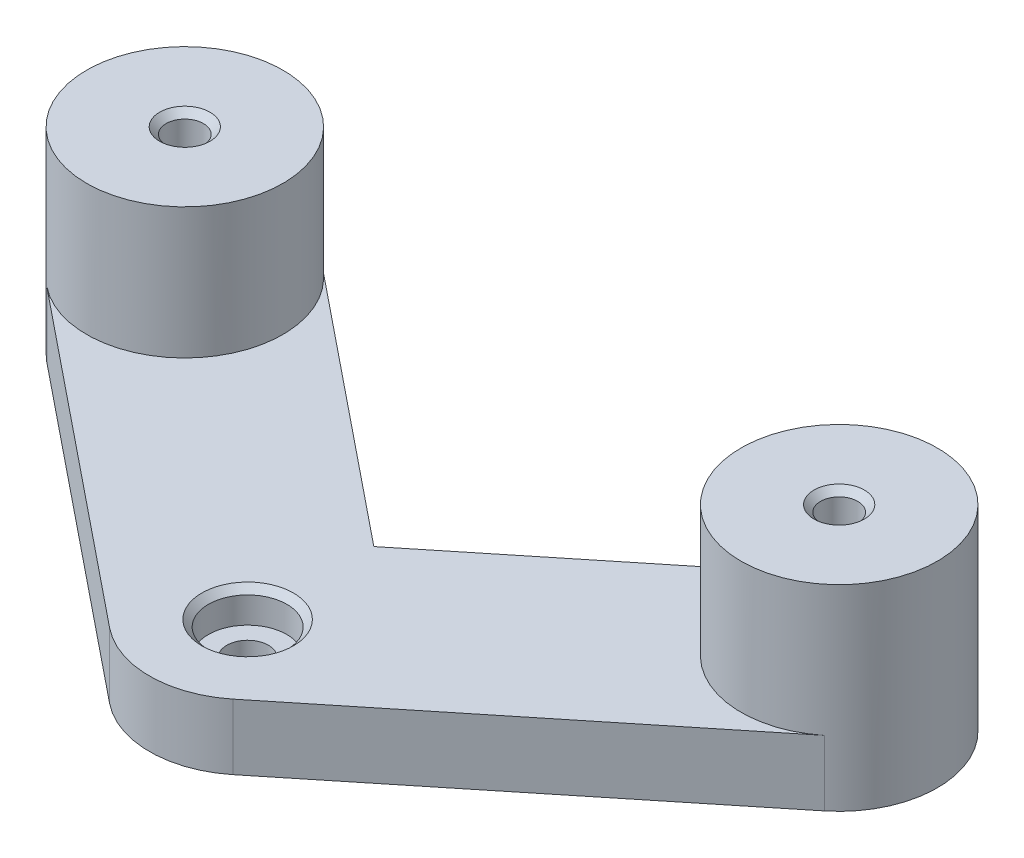
ISO-10303-21;
HEADER;
FILE_DESCRIPTION(('STEP AP214'),'2;1');
FILE_NAME('part.step','',(''),(''),'','','');
FILE_SCHEMA(('AUTOMOTIVE_DESIGN { 1 0 10303 214 1 1 1 1 }'));
ENDSEC;
DATA;
#1=APPLICATION_CONTEXT('core data for automotive mechanical design processes');
#2=APPLICATION_PROTOCOL_DEFINITION('international standard','automotive_design',2000,#1);
#3=PRODUCT_CONTEXT('',#1,'mechanical');
#4=PRODUCT('Part','Part','',(#3));
#5=PRODUCT_RELATED_PRODUCT_CATEGORY('part','',(#4));
#6=PRODUCT_DEFINITION_FORMATION('','',#4);
#7=PRODUCT_DEFINITION_CONTEXT('part definition',#1,'design');
#8=PRODUCT_DEFINITION('design','',#6,#7);
#9=PRODUCT_DEFINITION_SHAPE('','',#8);
#10=(LENGTH_UNIT() NAMED_UNIT(*) SI_UNIT(.MILLI.,.METRE.));
#11=(NAMED_UNIT(*) PLANE_ANGLE_UNIT() SI_UNIT($,.RADIAN.));
#12=(NAMED_UNIT(*) SI_UNIT($,.STERADIAN.) SOLID_ANGLE_UNIT());
#13=UNCERTAINTY_MEASURE_WITH_UNIT(LENGTH_MEASURE(1.E-05),#10,'distance_accuracy_value','');
#14=(GEOMETRIC_REPRESENTATION_CONTEXT(3) GLOBAL_UNCERTAINTY_ASSIGNED_CONTEXT((#13)) GLOBAL_UNIT_ASSIGNED_CONTEXT((#10,
#11,#12)) REPRESENTATION_CONTEXT('',''));
#15=CARTESIAN_POINT('',(0.,0.,0.));
#16=DIRECTION('',(0.,0.,1.));
#17=DIRECTION('',(1.,0.,0.));
#18=AXIS2_PLACEMENT_3D('',#15,#16,#17);
#19=CARTESIAN_POINT('',(0.,10.,127.));
#20=DIRECTION('',(0.,-1.,0.));
#21=DIRECTION('',(0.,0.,-1.));
#22=AXIS2_PLACEMENT_3D('',#19,#20,#21);
#23=CYLINDRICAL_SURFACE('',#22,3.17499999999998);
#24=CARTESIAN_POINT('',(0.,0.,127.));
#25=DIRECTION('',(0.,1.,0.));
#26=DIRECTION('',(0.,0.,1.));
#27=AXIS2_PLACEMENT_3D('',#24,#25,#26);
#28=CIRCLE('',#27,3.17499999999998);
#29=CARTESIAN_POINT('',(0.,0.,130.175));
#30=VERTEX_POINT('',#29);
#31=EDGE_CURVE('E140',#30,#30,#28,.T.);
#32=ORIENTED_EDGE('',*,*,#31,.F.);
#33=EDGE_LOOP('',(#32));
#34=FACE_BOUND('',#33,.T.);
#35=CARTESIAN_POINT('',(0.,5.,127.));
#36=DIRECTION('',(0.,1.,0.));
#37=DIRECTION('',(0.,0.,1.));
#38=AXIS2_PLACEMENT_3D('',#35,#36,#37);
#39=CIRCLE('',#38,3.17499999999998);
#40=CARTESIAN_POINT('',(0.,5.,130.175));
#41=VERTEX_POINT('',#40);
#42=EDGE_CURVE('E159',#41,#41,#39,.T.);
#43=ORIENTED_EDGE('',*,*,#42,.T.);
#44=EDGE_LOOP('',(#43));
#45=FACE_BOUND('',#44,.T.);
#46=ADVANCED_FACE('F39',(#34,#45),#23,.F.);
#47=CARTESIAN_POINT('',(-50.000000000001,10.,86.6025403784433));
#48=DIRECTION('',(0.,1.,0.));
#49=DIRECTION('',(0.,0.,1.));
#50=AXIS2_PLACEMENT_3D('',#47,#48,#49);
#51=PLANE('',#50);
#52=CARTESIAN_POINT('',(0.,10.,127.));
#53=DIRECTION('',(0.,1.,0.));
#54=DIRECTION('',(0.,0.,1.));
#55=AXIS2_PLACEMENT_3D('',#52,#53,#54);
#56=CIRCLE('',#55,7.00000000000001);
#57=CARTESIAN_POINT('',(0.,10.,134.));
#58=VERTEX_POINT('',#57);
#59=EDGE_CURVE('E173',#58,#58,#56,.F.);
#60=ORIENTED_EDGE('',*,*,#59,.T.);
#61=EDGE_LOOP('',(#60));
#62=FACE_BOUND('',#61,.T.);
#63=DIRECTION('',(0.777843498823097,0.,-0.628458026711922));
#64=VECTOR('',#63,1.);
#65=CARTESIAN_POINT('',(9.42687040067889,10.,138.667652482346));
#66=LINE('',#65,#64);
#67=CARTESIAN_POINT('',(9.42687040067889,10.,138.667652482346));
#68=VERTEX_POINT('',#67);
#69=CARTESIAN_POINT('',(59.426870400678,10.,98.2701928607908));
#70=VERTEX_POINT('',#69);
#71=EDGE_CURVE('E109',#68,#70,#66,.T.);
#72=ORIENTED_EDGE('',*,*,#71,.T.);
#73=CARTESIAN_POINT('',(49.9999999999992,10.,86.6025403784444));
#74=DIRECTION('',(0.,1.,0.));
#75=DIRECTION('',(0.,0.,1.));
#76=AXIS2_PLACEMENT_3D('',#73,#74,#75);
#77=CIRCLE('',#76,15.);
#78=CARTESIAN_POINT('',(40.5731295993204,10.,74.9348878960979));
#79=VERTEX_POINT('',#78);
#80=EDGE_CURVE('E266',#79,#70,#77,.T.);
#81=ORIENTED_EDGE('',*,*,#80,.F.);
#82=DIRECTION('',(-0.777843498823097,0.,0.628458026711922));
#83=VECTOR('',#82,1.);
#84=CARTESIAN_POINT('',(0.,10.,107.715915190272));
#85=LINE('',#84,#83);
#86=CARTESIAN_POINT('',(0.,10.,107.715915190272));
#87=VERTEX_POINT('',#86);
#88=EDGE_CURVE('E57',#79,#87,#85,.T.);
#89=ORIENTED_EDGE('',*,*,#88,.T.);
#90=DIRECTION('',(-0.7778434988231,0.,-0.628458026711918));
#91=VECTOR('',#90,1.);
#92=CARTESIAN_POINT('',(-40.5731295993223,10.,74.9348878960968));
#93=LINE('',#92,#91);
#94=CARTESIAN_POINT('',(-40.5731295993223,10.,74.9348878960968));
#95=VERTEX_POINT('',#94);
#96=EDGE_CURVE('E130',#87,#95,#93,.T.);
#97=ORIENTED_EDGE('',*,*,#96,.T.);
#98=CARTESIAN_POINT('',(-50.000000000001,10.,86.6025403784433));
#99=DIRECTION('',(0.,1.,0.));
#100=DIRECTION('',(0.,0.,1.));
#101=AXIS2_PLACEMENT_3D('',#98,#99,#100);
#102=CIRCLE('',#101,15.);
#103=CARTESIAN_POINT('',(-59.4268704006798,10.,98.2701928607898));
#104=VERTEX_POINT('',#103);
#105=EDGE_CURVE('E98',#104,#95,#102,.T.);
#106=ORIENTED_EDGE('',*,*,#105,.F.);
#107=DIRECTION('',(0.7778434988231,0.,0.628458026711918));
#108=VECTOR('',#107,1.);
#109=CARTESIAN_POINT('',(-59.4268704006798,10.,98.2701928607898));
#110=LINE('',#109,#108);
#111=CARTESIAN_POINT('',(-9.42687040067872,10.,138.667652482346));
#112=VERTEX_POINT('',#111);
#113=EDGE_CURVE('E111',#104,#112,#110,.T.);
#114=ORIENTED_EDGE('',*,*,#113,.T.);
#115=CARTESIAN_POINT('',(0.,10.,127.));
#116=DIRECTION('',(0.,1.,0.));
#117=DIRECTION('',(0.,0.,1.));
#118=AXIS2_PLACEMENT_3D('',#115,#116,#117);
#119=CIRCLE('',#118,15.);
#120=EDGE_CURVE('E105',#112,#68,#119,.T.);
#121=ORIENTED_EDGE('',*,*,#120,.T.);
#122=EDGE_LOOP('',(#72,#81,#89,#97,#106,#114,#121));
#123=FACE_BOUND('',#122,.T.);
#124=ADVANCED_FACE('F107',(#62,#123),#51,.T.);
#125=CARTESIAN_POINT('',(-50.000000000001,0.,86.6025403784433));
#126=DIRECTION('',(0.,1.,0.));
#127=DIRECTION('',(0.,0.,1.));
#128=AXIS2_PLACEMENT_3D('',#125,#126,#127);
#129=PLANE('',#128);
#130=CARTESIAN_POINT('',(-50.000000000001,0.,86.6025403784433));
#131=DIRECTION('',(0.,1.,0.));
#132=DIRECTION('',(0.,0.,1.));
#133=AXIS2_PLACEMENT_3D('',#130,#131,#132);
#134=CIRCLE('',#133,2.85);
#135=CARTESIAN_POINT('',(-50.000000000001,0.,89.4525403784433));
#136=VERTEX_POINT('',#135);
#137=EDGE_CURVE('E259',#136,#136,#134,.T.);
#138=ORIENTED_EDGE('',*,*,#137,.T.);
#139=EDGE_LOOP('',(#138));
#140=FACE_BOUND('',#139,.T.);
#141=CARTESIAN_POINT('',(49.9999999999992,0.,86.6025403784444));
#142=DIRECTION('',(0.,1.,0.));
#143=DIRECTION('',(0.,0.,1.));
#144=AXIS2_PLACEMENT_3D('',#141,#142,#143);
#145=CIRCLE('',#144,2.85);
#146=CARTESIAN_POINT('',(49.9999999999992,0.,89.4525403784444));
#147=VERTEX_POINT('',#146);
#148=EDGE_CURVE('E162',#147,#147,#145,.T.);
#149=ORIENTED_EDGE('',*,*,#148,.T.);
#150=EDGE_LOOP('',(#149));
#151=FACE_BOUND('',#150,.T.);
#152=CARTESIAN_POINT('',(-50.000000000001,0.,86.6025403784433));
#153=DIRECTION('',(0.,1.,0.));
#154=DIRECTION('',(0.,0.,1.));
#155=AXIS2_PLACEMENT_3D('',#152,#153,#154);
#156=CIRCLE('',#155,15.);
#157=CARTESIAN_POINT('',(-40.5731295993223,0.,74.9348878960968));
#158=VERTEX_POINT('',#157);
#159=CARTESIAN_POINT('',(-59.4268704006798,0.,98.2701928607898));
#160=VERTEX_POINT('',#159);
#161=EDGE_CURVE('E136',#158,#160,#156,.T.);
#162=ORIENTED_EDGE('',*,*,#161,.F.);
#163=DIRECTION('',(-0.7778434988231,0.,-0.628458026711918));
#164=VECTOR('',#163,1.);
#165=CARTESIAN_POINT('',(-40.5731295993223,0.,74.9348878960968));
#166=LINE('',#165,#164);
#167=CARTESIAN_POINT('',(0.,0.,107.715915190272));
#168=VERTEX_POINT('',#167);
#169=EDGE_CURVE('E91',#168,#158,#166,.T.);
#170=ORIENTED_EDGE('',*,*,#169,.F.);
#171=DIRECTION('',(-0.777843498823097,0.,0.628458026711922));
#172=VECTOR('',#171,1.);
#173=CARTESIAN_POINT('',(0.,0.,107.715915190272));
#174=LINE('',#173,#172);
#175=CARTESIAN_POINT('',(40.5731295993204,0.,74.9348878960979));
#176=VERTEX_POINT('',#175);
#177=EDGE_CURVE('E84',#176,#168,#174,.T.);
#178=ORIENTED_EDGE('',*,*,#177,.F.);
#179=CARTESIAN_POINT('',(49.9999999999992,0.,86.6025403784444));
#180=DIRECTION('',(0.,1.,0.));
#181=DIRECTION('',(0.,0.,1.));
#182=AXIS2_PLACEMENT_3D('',#179,#180,#181);
#183=CIRCLE('',#182,15.);
#184=CARTESIAN_POINT('',(59.426870400678,0.,98.2701928607908));
#185=VERTEX_POINT('',#184);
#186=EDGE_CURVE('E145',#185,#176,#183,.T.);
#187=ORIENTED_EDGE('',*,*,#186,.F.);
#188=DIRECTION('',(0.777843498823097,0.,-0.628458026711922));
#189=VECTOR('',#188,1.);
#190=CARTESIAN_POINT('',(9.42687040067889,0.,138.667652482346));
#191=LINE('',#190,#189);
#192=CARTESIAN_POINT('',(9.42687040067889,0.,138.667652482346));
#193=VERTEX_POINT('',#192);
#194=EDGE_CURVE('E143',#193,#185,#191,.T.);
#195=ORIENTED_EDGE('',*,*,#194,.F.);
#196=CARTESIAN_POINT('',(0.,0.,127.));
#197=DIRECTION('',(0.,1.,0.));
#198=DIRECTION('',(0.,0.,1.));
#199=AXIS2_PLACEMENT_3D('',#196,#197,#198);
#200=CIRCLE('',#199,15.);
#201=CARTESIAN_POINT('',(-9.42687040067872,0.,138.667652482346));
#202=VERTEX_POINT('',#201);
#203=EDGE_CURVE('E120',#202,#193,#200,.T.);
#204=ORIENTED_EDGE('',*,*,#203,.F.);
#205=DIRECTION('',(0.7778434988231,0.,0.628458026711918));
#206=VECTOR('',#205,1.);
#207=CARTESIAN_POINT('',(-59.4268704006798,0.,98.2701928607898));
#208=LINE('',#207,#206);
#209=EDGE_CURVE('E139',#160,#202,#208,.T.);
#210=ORIENTED_EDGE('',*,*,#209,.F.);
#211=EDGE_LOOP('',(#162,#170,#178,#187,#195,#204,#210));
#212=FACE_BOUND('',#211,.T.);
#213=ORIENTED_EDGE('',*,*,#31,.T.);
#214=EDGE_LOOP('',(#213));
#215=FACE_BOUND('',#214,.T.);
#216=ADVANCED_FACE('F196',(#140,#151,#212,#215),#129,.F.);
#217=CARTESIAN_POINT('',(-50.000000000001,10.,86.6025403784433));
#218=DIRECTION('',(0.,-1.,0.));
#219=DIRECTION('',(0.,0.,-1.));
#220=AXIS2_PLACEMENT_3D('',#217,#218,#219);
#221=CYLINDRICAL_SURFACE('',#220,15.);
#222=ORIENTED_EDGE('',*,*,#161,.T.);
#223=DIRECTION('',(0.,-1.,0.));
#224=VECTOR('',#223,1.);
#225=CARTESIAN_POINT('',(-59.4268704006798,10.,98.2701928607898));
#226=LINE('',#225,#224);
#227=EDGE_CURVE('E156',#104,#160,#226,.T.);
#228=ORIENTED_EDGE('',*,*,#227,.F.);
#229=ORIENTED_EDGE('',*,*,#105,.T.);
#230=DIRECTION('',(0.,-1.,0.));
#231=VECTOR('',#230,1.);
#232=CARTESIAN_POINT('',(-40.5731295993223,10.,74.9348878960968));
#233=LINE('',#232,#231);
#234=EDGE_CURVE('E135',#95,#158,#233,.T.);
#235=ORIENTED_EDGE('',*,*,#234,.T.);
#236=EDGE_LOOP('',(#222,#228,#229,#235));
#237=FACE_BOUND('',#236,.T.);
#238=CARTESIAN_POINT('',(-50.000000000001,30.,86.6025403784433));
#239=DIRECTION('',(0.,1.,0.));
#240=DIRECTION('',(0.,0.,1.));
#241=AXIS2_PLACEMENT_3D('',#238,#239,#240);
#242=CIRCLE('',#241,15.);
#243=CARTESIAN_POINT('',(-50.000000000001,30.,101.602540378443));
#244=VERTEX_POINT('',#243);
#245=EDGE_CURVE('E268',#244,#244,#242,.T.);
#246=ORIENTED_EDGE('',*,*,#245,.F.);
#247=EDGE_LOOP('',(#246));
#248=FACE_BOUND('',#247,.T.);
#249=ADVANCED_FACE('F207',(#237,#248),#221,.T.);
#250=CARTESIAN_POINT('',(-59.4268704006798,10.,98.2701928607898));
#251=DIRECTION('',(0.628458026711918,0.,-0.7778434988231));
#252=DIRECTION('',(-0.7778434988231,0.,-0.628458026711918));
#253=AXIS2_PLACEMENT_3D('',#250,#251,#252);
#254=PLANE('',#253);
#255=ORIENTED_EDGE('',*,*,#209,.T.);
#256=DIRECTION('',(0.,-1.,0.));
#257=VECTOR('',#256,1.);
#258=CARTESIAN_POINT('',(-9.42687040067872,10.,138.667652482346));
#259=LINE('',#258,#257);
#260=EDGE_CURVE('E123',#112,#202,#259,.T.);
#261=ORIENTED_EDGE('',*,*,#260,.F.);
#262=ORIENTED_EDGE('',*,*,#113,.F.);
#263=ORIENTED_EDGE('',*,*,#227,.T.);
#264=EDGE_LOOP('',(#255,#261,#262,#263));
#265=FACE_BOUND('',#264,.T.);
#266=ADVANCED_FACE('F223',(#265),#254,.F.);
#267=CARTESIAN_POINT('',(0.,10.,127.));
#268=DIRECTION('',(0.,-1.,0.));
#269=DIRECTION('',(0.,0.,-1.));
#270=AXIS2_PLACEMENT_3D('',#267,#268,#269);
#271=CYLINDRICAL_SURFACE('',#270,15.);
#272=ORIENTED_EDGE('',*,*,#203,.T.);
#273=DIRECTION('',(0.,-1.,0.));
#274=VECTOR('',#273,1.);
#275=CARTESIAN_POINT('',(9.42687040067889,10.,138.667652482346));
#276=LINE('',#275,#274);
#277=EDGE_CURVE('E117',#68,#193,#276,.T.);
#278=ORIENTED_EDGE('',*,*,#277,.F.);
#279=ORIENTED_EDGE('',*,*,#120,.F.);
#280=ORIENTED_EDGE('',*,*,#260,.T.);
#281=EDGE_LOOP('',(#272,#278,#279,#280));
#282=FACE_BOUND('',#281,.T.);
#283=ADVANCED_FACE('F118',(#282),#271,.T.);
#284=CARTESIAN_POINT('',(9.42687040067889,10.,138.667652482346));
#285=DIRECTION('',(-0.628458026711922,0.,-0.777843498823097));
#286=DIRECTION('',(-0.777843498823097,0.,0.628458026711922));
#287=AXIS2_PLACEMENT_3D('',#284,#285,#286);
#288=PLANE('',#287);
#289=ORIENTED_EDGE('',*,*,#194,.T.);
#290=DIRECTION('',(0.,-1.,0.));
#291=VECTOR('',#290,1.);
#292=CARTESIAN_POINT('',(59.426870400678,10.,98.2701928607908));
#293=LINE('',#292,#291);
#294=EDGE_CURVE('E124',#70,#185,#293,.T.);
#295=ORIENTED_EDGE('',*,*,#294,.F.);
#296=ORIENTED_EDGE('',*,*,#71,.F.);
#297=ORIENTED_EDGE('',*,*,#277,.T.);
#298=EDGE_LOOP('',(#289,#295,#296,#297));
#299=FACE_BOUND('',#298,.T.);
#300=ADVANCED_FACE('F126',(#299),#288,.F.);
#301=CARTESIAN_POINT('',(49.9999999999992,10.,86.6025403784444));
#302=DIRECTION('',(0.,-1.,0.));
#303=DIRECTION('',(0.,0.,-1.));
#304=AXIS2_PLACEMENT_3D('',#301,#302,#303);
#305=CYLINDRICAL_SURFACE('',#304,15.);
#306=ORIENTED_EDGE('',*,*,#186,.T.);
#307=DIRECTION('',(0.,-1.,0.));
#308=VECTOR('',#307,1.);
#309=CARTESIAN_POINT('',(40.5731295993204,10.,74.9348878960979));
#310=LINE('',#309,#308);
#311=EDGE_CURVE('E152',#79,#176,#310,.T.);
#312=ORIENTED_EDGE('',*,*,#311,.F.);
#313=ORIENTED_EDGE('',*,*,#80,.T.);
#314=ORIENTED_EDGE('',*,*,#294,.T.);
#315=EDGE_LOOP('',(#306,#312,#313,#314));
#316=FACE_BOUND('',#315,.T.);
#317=CARTESIAN_POINT('',(49.9999999999992,30.,86.6025403784444));
#318=DIRECTION('',(0.,1.,0.));
#319=DIRECTION('',(0.,0.,1.));
#320=AXIS2_PLACEMENT_3D('',#317,#318,#319);
#321=CIRCLE('',#320,15.);
#322=CARTESIAN_POINT('',(49.9999999999992,30.,101.602540378444));
#323=VERTEX_POINT('',#322);
#324=EDGE_CURVE('E262',#323,#323,#321,.T.);
#325=ORIENTED_EDGE('',*,*,#324,.F.);
#326=EDGE_LOOP('',(#325));
#327=FACE_BOUND('',#326,.T.);
#328=ADVANCED_FACE('F215',(#316,#327),#305,.T.);
#329=CARTESIAN_POINT('',(0.,10.,107.715915190272));
#330=DIRECTION('',(0.628458026711922,0.,0.777843498823097));
#331=DIRECTION('',(0.777843498823097,0.,-0.628458026711922));
#332=AXIS2_PLACEMENT_3D('',#329,#330,#331);
#333=PLANE('',#332);
#334=ORIENTED_EDGE('',*,*,#177,.T.);
#335=DIRECTION('',(0.,-1.,0.));
#336=VECTOR('',#335,1.);
#337=CARTESIAN_POINT('',(0.,10.,107.715915190272));
#338=LINE('',#337,#336);
#339=EDGE_CURVE('E150',#87,#168,#338,.T.);
#340=ORIENTED_EDGE('',*,*,#339,.F.);
#341=ORIENTED_EDGE('',*,*,#88,.F.);
#342=ORIENTED_EDGE('',*,*,#311,.T.);
#343=EDGE_LOOP('',(#334,#340,#341,#342));
#344=FACE_BOUND('',#343,.T.);
#345=ADVANCED_FACE('F212',(#344),#333,.F.);
#346=CARTESIAN_POINT('',(-40.5731295993223,10.,74.9348878960968));
#347=DIRECTION('',(-0.628458026711918,0.,0.7778434988231));
#348=DIRECTION('',(0.7778434988231,0.,0.628458026711918));
#349=AXIS2_PLACEMENT_3D('',#346,#347,#348);
#350=PLANE('',#349);
#351=ORIENTED_EDGE('',*,*,#169,.T.);
#352=ORIENTED_EDGE('',*,*,#234,.F.);
#353=ORIENTED_EDGE('',*,*,#96,.F.);
#354=ORIENTED_EDGE('',*,*,#339,.T.);
#355=EDGE_LOOP('',(#351,#352,#353,#354));
#356=FACE_BOUND('',#355,.T.);
#357=ADVANCED_FACE('F209',(#356),#350,.F.);
#358=CARTESIAN_POINT('',(-50.000000000001,30.,86.6025403784433));
#359=DIRECTION('',(0.,1.,0.));
#360=DIRECTION('',(0.,0.,1.));
#361=AXIS2_PLACEMENT_3D('',#358,#359,#360);
#362=PLANE('',#361);
#363=CARTESIAN_POINT('',(-50.000000000001,30.,86.6025403784433));
#364=DIRECTION('',(0.,1.,0.));
#365=DIRECTION('',(0.,0.,1.));
#366=AXIS2_PLACEMENT_3D('',#363,#364,#365);
#367=CIRCLE('',#366,3.85000000000001);
#368=CARTESIAN_POINT('',(-50.000000000001,30.,90.4525403784433));
#369=VERTEX_POINT('',#368);
#370=EDGE_CURVE('E11',#369,#369,#367,.F.);
#371=ORIENTED_EDGE('',*,*,#370,.T.);
#372=EDGE_LOOP('',(#371));
#373=FACE_BOUND('',#372,.T.);
#374=ORIENTED_EDGE('',*,*,#245,.T.);
#375=EDGE_LOOP('',(#374));
#376=FACE_BOUND('',#375,.T.);
#377=ADVANCED_FACE('F202',(#373,#376),#362,.T.);
#378=CARTESIAN_POINT('',(49.9999999999992,30.,86.6025403784444));
#379=DIRECTION('',(0.,1.,0.));
#380=DIRECTION('',(0.,0.,1.));
#381=AXIS2_PLACEMENT_3D('',#378,#379,#380);
#382=PLANE('',#381);
#383=CARTESIAN_POINT('',(49.9999999999992,30.,86.6025403784444));
#384=DIRECTION('',(0.,1.,0.));
#385=DIRECTION('',(0.,0.,1.));
#386=AXIS2_PLACEMENT_3D('',#383,#384,#385);
#387=CIRCLE('',#386,3.85000000000001);
#388=CARTESIAN_POINT('',(49.9999999999992,30.,90.4525403784444));
#389=VERTEX_POINT('',#388);
#390=EDGE_CURVE('E167',#389,#389,#387,.F.);
#391=ORIENTED_EDGE('',*,*,#390,.T.);
#392=EDGE_LOOP('',(#391));
#393=FACE_BOUND('',#392,.T.);
#394=ORIENTED_EDGE('',*,*,#324,.T.);
#395=EDGE_LOOP('',(#394));
#396=FACE_BOUND('',#395,.T.);
#397=ADVANCED_FACE('F254',(#393,#396),#382,.T.);
#398=CARTESIAN_POINT('',(49.9999999999992,-7.00000000000001,86.6025403784444));
#399=DIRECTION('',(0.,1.,0.));
#400=DIRECTION('',(0.,0.,1.));
#401=AXIS2_PLACEMENT_3D('',#398,#399,#400);
#402=CYLINDRICAL_SURFACE('',#401,2.85);
#403=CARTESIAN_POINT('',(49.9999999999992,29.,86.6025403784444));
#404=DIRECTION('',(0.,1.,0.));
#405=DIRECTION('',(0.,0.,1.));
#406=AXIS2_PLACEMENT_3D('',#403,#404,#405);
#407=CIRCLE('',#406,2.85);
#408=CARTESIAN_POINT('',(49.9999999999992,29.,89.4525403784444));
#409=VERTEX_POINT('',#408);
#410=EDGE_CURVE('E164',#409,#409,#407,.T.);
#411=ORIENTED_EDGE('',*,*,#410,.T.);
#412=EDGE_LOOP('',(#411));
#413=FACE_BOUND('',#412,.T.);
#414=ORIENTED_EDGE('',*,*,#148,.F.);
#415=EDGE_LOOP('',(#414));
#416=FACE_BOUND('',#415,.T.);
#417=ADVANCED_FACE('F251',(#413,#416),#402,.F.);
#418=CARTESIAN_POINT('',(-50.000000000001,-7.00000000000001,86.6025403784433));
#419=DIRECTION('',(0.,1.,0.));
#420=DIRECTION('',(0.,0.,1.));
#421=AXIS2_PLACEMENT_3D('',#418,#419,#420);
#422=CYLINDRICAL_SURFACE('',#421,2.85);
#423=CARTESIAN_POINT('',(-50.000000000001,29.,86.6025403784433));
#424=DIRECTION('',(0.,1.,0.));
#425=DIRECTION('',(0.,0.,1.));
#426=AXIS2_PLACEMENT_3D('',#423,#424,#425);
#427=CIRCLE('',#426,2.85);
#428=CARTESIAN_POINT('',(-50.000000000001,29.,89.4525403784433));
#429=VERTEX_POINT('',#428);
#430=EDGE_CURVE('E49',#429,#429,#427,.T.);
#431=ORIENTED_EDGE('',*,*,#430,.T.);
#432=EDGE_LOOP('',(#431));
#433=FACE_BOUND('',#432,.T.);
#434=ORIENTED_EDGE('',*,*,#137,.F.);
#435=EDGE_LOOP('',(#434));
#436=FACE_BOUND('',#435,.T.);
#437=ADVANCED_FACE('F178',(#433,#436),#422,.F.);
#438=CARTESIAN_POINT('',(0.,5.,127.));
#439=DIRECTION('',(0.,1.,0.));
#440=DIRECTION('',(0.,0.,1.));
#441=AXIS2_PLACEMENT_3D('',#438,#439,#440);
#442=CYLINDRICAL_SURFACE('',#441,6.);
#443=CARTESIAN_POINT('',(0.,8.99999999999999,127.));
#444=DIRECTION('',(0.,1.,0.));
#445=DIRECTION('',(0.,0.,1.));
#446=AXIS2_PLACEMENT_3D('',#443,#444,#445);
#447=CIRCLE('',#446,6.);
#448=CARTESIAN_POINT('',(0.,8.99999999999999,133.));
#449=VERTEX_POINT('',#448);
#450=EDGE_CURVE('E170',#449,#449,#447,.T.);
#451=ORIENTED_EDGE('',*,*,#450,.T.);
#452=EDGE_LOOP('',(#451));
#453=FACE_BOUND('',#452,.T.);
#454=CARTESIAN_POINT('',(0.,5.,127.));
#455=DIRECTION('',(0.,1.,0.));
#456=DIRECTION('',(0.,0.,1.));
#457=AXIS2_PLACEMENT_3D('',#454,#455,#456);
#458=CIRCLE('',#457,6.);
#459=CARTESIAN_POINT('',(0.,5.,133.));
#460=VERTEX_POINT('',#459);
#461=EDGE_CURVE('E163',#460,#460,#458,.T.);
#462=ORIENTED_EDGE('',*,*,#461,.F.);
#463=EDGE_LOOP('',(#462));
#464=FACE_BOUND('',#463,.T.);
#465=ADVANCED_FACE('F244',(#453,#464),#442,.F.);
#466=CARTESIAN_POINT('',(0.,5.,127.));
#467=DIRECTION('',(0.,1.,0.));
#468=DIRECTION('',(0.,0.,1.));
#469=AXIS2_PLACEMENT_3D('',#466,#467,#468);
#470=PLANE('',#469);
#471=ORIENTED_EDGE('',*,*,#42,.F.);
#472=EDGE_LOOP('',(#471));
#473=FACE_BOUND('',#472,.T.);
#474=ORIENTED_EDGE('',*,*,#461,.T.);
#475=EDGE_LOOP('',(#474));
#476=FACE_BOUND('',#475,.T.);
#477=ADVANCED_FACE('F235',(#473,#476),#470,.T.);
#478=CARTESIAN_POINT('',(49.9999999999992,29.,86.6025403784444));
#479=DIRECTION('',(0.,1.,0.));
#480=DIRECTION('',(0.,0.,1.));
#481=AXIS2_PLACEMENT_3D('',#478,#479,#480);
#482=CONICAL_SURFACE('',#481,2.85,0.785398163397452);
#483=ORIENTED_EDGE('',*,*,#390,.F.);
#484=EDGE_LOOP('',(#483));
#485=FACE_BOUND('',#484,.T.);
#486=ORIENTED_EDGE('',*,*,#410,.F.);
#487=EDGE_LOOP('',(#486));
#488=FACE_BOUND('',#487,.T.);
#489=ADVANCED_FACE('F187',(#485,#488),#482,.F.);
#490=CARTESIAN_POINT('',(0.,8.99999999999999,127.));
#491=DIRECTION('',(0.,1.,0.));
#492=DIRECTION('',(0.,0.,1.));
#493=AXIS2_PLACEMENT_3D('',#490,#491,#492);
#494=CONICAL_SURFACE('',#493,6.,0.785398163397445);
#495=ORIENTED_EDGE('',*,*,#59,.F.);
#496=EDGE_LOOP('',(#495));
#497=FACE_BOUND('',#496,.T.);
#498=ORIENTED_EDGE('',*,*,#450,.F.);
#499=EDGE_LOOP('',(#498));
#500=FACE_BOUND('',#499,.T.);
#501=ADVANCED_FACE('F182',(#497,#500),#494,.F.);
#502=CARTESIAN_POINT('',(-50.000000000001,29.,86.6025403784433));
#503=DIRECTION('',(0.,1.,0.));
#504=DIRECTION('',(0.,0.,1.));
#505=AXIS2_PLACEMENT_3D('',#502,#503,#504);
#506=CONICAL_SURFACE('',#505,2.85,0.785398163397449);
#507=ORIENTED_EDGE('',*,*,#370,.F.);
#508=EDGE_LOOP('',(#507));
#509=FACE_BOUND('',#508,.T.);
#510=ORIENTED_EDGE('',*,*,#430,.F.);
#511=EDGE_LOOP('',(#510));
#512=FACE_BOUND('',#511,.T.);
#513=ADVANCED_FACE('F42',(#509,#512),#506,.F.);
#514=CLOSED_SHELL('',(#46,#124,#216,#249,#266,#283,#300,#328,#345,#357,#377,#397,#417,#437,#465,
#477,#489,#501,#513));
#515=MANIFOLD_SOLID_BREP('B2',#514);
#516=ADVANCED_BREP_SHAPE_REPRESENTATION('',(#18,#515),#14);
#517=SHAPE_DEFINITION_REPRESENTATION(#9,#516);
ENDSEC;
END-ISO-10303-21;
